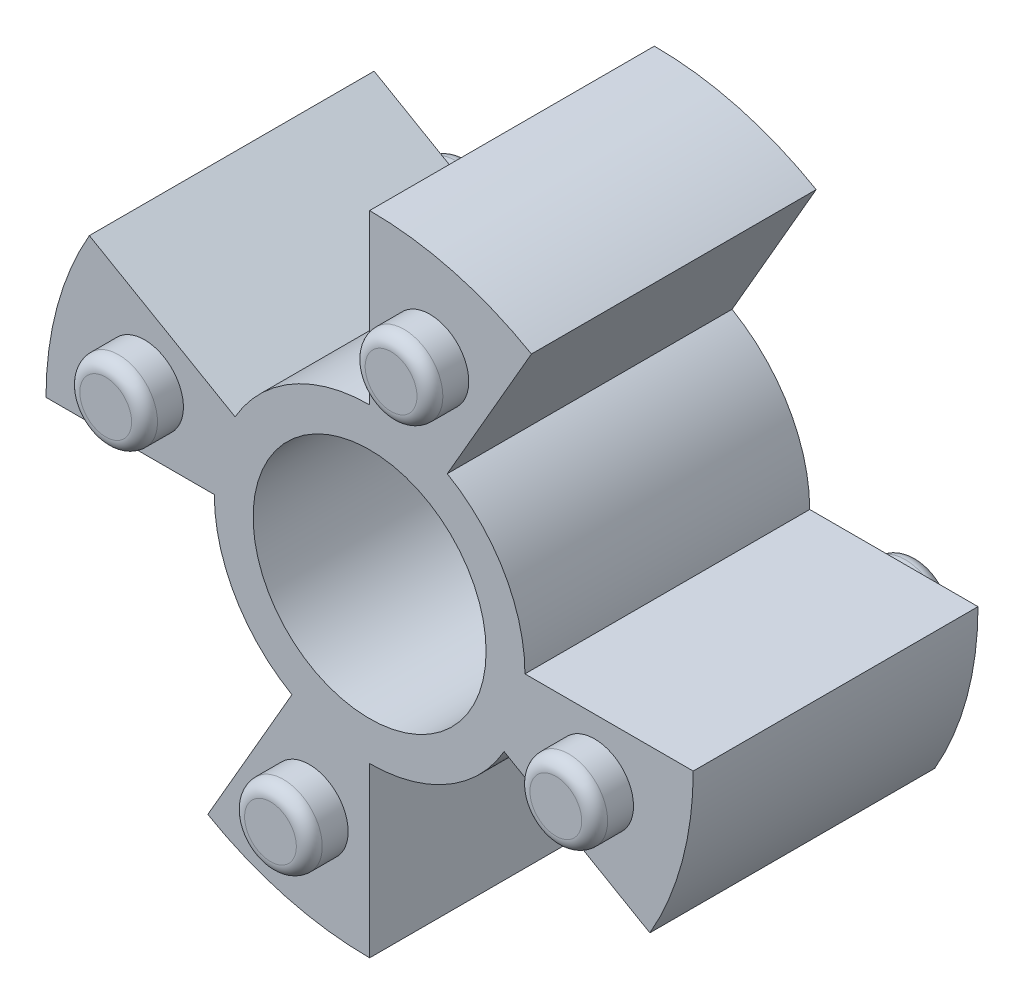
ISO-10303-21;
HEADER;
FILE_DESCRIPTION(('STEP AP214'),'2;1');
FILE_NAME('part.step','',(''),(''),'','','');
FILE_SCHEMA(('AUTOMOTIVE_DESIGN { 1 0 10303 214 1 1 1 1 }'));
ENDSEC;
DATA;
#1=APPLICATION_CONTEXT('core data for automotive mechanical design processes');
#2=APPLICATION_PROTOCOL_DEFINITION('international standard','automotive_design',2000,#1);
#3=PRODUCT_CONTEXT('',#1,'mechanical');
#4=PRODUCT('Part','Part','',(#3));
#5=PRODUCT_RELATED_PRODUCT_CATEGORY('part','',(#4));
#6=PRODUCT_DEFINITION_FORMATION('','',#4);
#7=PRODUCT_DEFINITION_CONTEXT('part definition',#1,'design');
#8=PRODUCT_DEFINITION('design','',#6,#7);
#9=PRODUCT_DEFINITION_SHAPE('','',#8);
#10=(LENGTH_UNIT() NAMED_UNIT(*) SI_UNIT(.MILLI.,.METRE.));
#11=(NAMED_UNIT(*) PLANE_ANGLE_UNIT() SI_UNIT($,.RADIAN.));
#12=(NAMED_UNIT(*) SI_UNIT($,.STERADIAN.) SOLID_ANGLE_UNIT());
#13=UNCERTAINTY_MEASURE_WITH_UNIT(LENGTH_MEASURE(1.E-05),#10,'distance_accuracy_value','');
#14=(GEOMETRIC_REPRESENTATION_CONTEXT(3) GLOBAL_UNCERTAINTY_ASSIGNED_CONTEXT((#13)) GLOBAL_UNIT_ASSIGNED_CONTEXT((#10,
#11,#12)) REPRESENTATION_CONTEXT('',''));
#15=CARTESIAN_POINT('',(0.,0.,0.));
#16=DIRECTION('',(0.,0.,1.));
#17=DIRECTION('',(1.,0.,0.));
#18=AXIS2_PLACEMENT_3D('',#15,#16,#17);
#19=CARTESIAN_POINT('',(0.,0.,5.5));
#20=DIRECTION('',(0.,0.,1.));
#21=DIRECTION('',(1.,0.,0.));
#22=AXIS2_PLACEMENT_3D('',#19,#20,#21);
#23=PLANE('',#22);
#24=CARTESIAN_POINT('',(-8.69333243660161,2.32937140592269,5.5));
#25=DIRECTION('',(0.,0.,1.));
#26=DIRECTION('',(-1.,0.,0.));
#27=AXIS2_PLACEMENT_3D('',#24,#25,#26);
#28=CIRCLE('',#27,1.5);
#29=CARTESIAN_POINT('',(-10.1933324366016,2.32937140592269,5.5));
#30=VERTEX_POINT('',#29);
#31=EDGE_CURVE('E294',#30,#30,#28,.T.);
#32=ORIENTED_EDGE('',*,*,#31,.F.);
#33=EDGE_LOOP('',(#32));
#34=FACE_BOUND('',#33,.T.);
#35=CARTESIAN_POINT('',(8.69333243660161,-2.32937140592269,5.5));
#36=DIRECTION('',(0.,0.,1.));
#37=DIRECTION('',(1.,0.,0.));
#38=AXIS2_PLACEMENT_3D('',#35,#36,#37);
#39=CIRCLE('',#38,1.5);
#40=CARTESIAN_POINT('',(10.1933324366016,-2.32937140592269,5.5));
#41=VERTEX_POINT('',#40);
#42=EDGE_CURVE('E305',#41,#41,#39,.T.);
#43=ORIENTED_EDGE('',*,*,#42,.F.);
#44=EDGE_LOOP('',(#43));
#45=FACE_BOUND('',#44,.T.);
#46=DIRECTION('',(-1.,0.,0.));
#47=VECTOR('',#46,1.);
#48=CARTESIAN_POINT('',(-12.5,1.30930550206618E-13,5.5));
#49=LINE('',#48,#47);
#50=CARTESIAN_POINT('',(-6.,0.,5.5));
#51=VERTEX_POINT('',#50);
#52=CARTESIAN_POINT('',(-12.5,1.30930550206618E-13,5.5));
#53=VERTEX_POINT('',#52);
#54=EDGE_CURVE('E157',#51,#53,#49,.T.);
#55=ORIENTED_EDGE('',*,*,#54,.F.);
#56=CARTESIAN_POINT('',(0.,0.,5.5));
#57=DIRECTION('',(0.,0.,-1.));
#58=DIRECTION('',(0.,-1.,0.));
#59=AXIS2_PLACEMENT_3D('',#56,#57,#58);
#60=CIRCLE('',#59,6.);
#61=CARTESIAN_POINT('',(-3.00000000000004,-5.19615242270661,5.5));
#62=VERTEX_POINT('',#61);
#63=EDGE_CURVE('E313',#62,#51,#60,.T.);
#64=ORIENTED_EDGE('',*,*,#63,.F.);
#65=DIRECTION('',(0.500000000000007,0.866025403784435,0.));
#66=VECTOR('',#65,1.);
#67=CARTESIAN_POINT('',(-6.25000000000008,-10.8253175473054,5.5));
#68=LINE('',#67,#66);
#69=CARTESIAN_POINT('',(-6.25000000000008,-10.8253175473054,5.5));
#70=VERTEX_POINT('',#69);
#71=EDGE_CURVE('E307',#70,#62,#68,.T.);
#72=ORIENTED_EDGE('',*,*,#71,.F.);
#73=CARTESIAN_POINT('',(0.,0.,5.5));
#74=DIRECTION('',(0.,0.,1.));
#75=DIRECTION('',(1.,0.,0.));
#76=AXIS2_PLACEMENT_3D('',#73,#74,#75);
#77=CIRCLE('',#76,12.5);
#78=CARTESIAN_POINT('',(0.,-12.5,5.5));
#79=VERTEX_POINT('',#78);
#80=EDGE_CURVE('E165',#70,#79,#77,.T.);
#81=ORIENTED_EDGE('',*,*,#80,.T.);
#82=DIRECTION('',(0.,-1.,0.));
#83=VECTOR('',#82,1.);
#84=CARTESIAN_POINT('',(0.,-12.5,5.5));
#85=LINE('',#84,#83);
#86=CARTESIAN_POINT('',(0.,-6.,5.5));
#87=VERTEX_POINT('',#86);
#88=EDGE_CURVE('E327',#87,#79,#85,.T.);
#89=ORIENTED_EDGE('',*,*,#88,.F.);
#90=CARTESIAN_POINT('',(0.,0.,5.5));
#91=DIRECTION('',(0.,0.,-1.));
#92=DIRECTION('',(1.,0.,0.));
#93=AXIS2_PLACEMENT_3D('',#90,#91,#92);
#94=CIRCLE('',#93,6.);
#95=CARTESIAN_POINT('',(5.19615242270664,-2.99999999999998,5.5));
#96=VERTEX_POINT('',#95);
#97=EDGE_CURVE('E333',#96,#87,#94,.T.);
#98=ORIENTED_EDGE('',*,*,#97,.F.);
#99=DIRECTION('',(-0.86602540378444,0.499999999999998,0.));
#100=VECTOR('',#99,1.);
#101=CARTESIAN_POINT('',(10.8253175473055,-6.24999999999997,5.5));
#102=LINE('',#101,#100);
#103=CARTESIAN_POINT('',(10.8253175473055,-6.24999999999997,5.5));
#104=VERTEX_POINT('',#103);
#105=EDGE_CURVE('E320',#104,#96,#102,.T.);
#106=ORIENTED_EDGE('',*,*,#105,.F.);
#107=CARTESIAN_POINT('',(12.5,0.,5.5));
#108=VERTEX_POINT('',#107);
#109=EDGE_CURVE('E406',#104,#108,#77,.T.);
#110=ORIENTED_EDGE('',*,*,#109,.T.);
#111=DIRECTION('',(1.,0.,0.));
#112=VECTOR('',#111,1.);
#113=CARTESIAN_POINT('',(12.5,0.,5.5));
#114=LINE('',#113,#112);
#115=CARTESIAN_POINT('',(6.,0.,5.5));
#116=VERTEX_POINT('',#115);
#117=EDGE_CURVE('E350',#116,#108,#114,.T.);
#118=ORIENTED_EDGE('',*,*,#117,.F.);
#119=CARTESIAN_POINT('',(0.,0.,5.5));
#120=DIRECTION('',(0.,0.,-1.));
#121=DIRECTION('',(0.,1.,0.));
#122=AXIS2_PLACEMENT_3D('',#119,#120,#121);
#123=CIRCLE('',#122,6.);
#124=CARTESIAN_POINT('',(3.,5.19615242270663,5.5));
#125=VERTEX_POINT('',#124);
#126=EDGE_CURVE('E359',#125,#116,#123,.T.);
#127=ORIENTED_EDGE('',*,*,#126,.F.);
#128=DIRECTION('',(-0.500000000000001,-0.866025403784438,0.));
#129=VECTOR('',#128,1.);
#130=CARTESIAN_POINT('',(6.25000000000001,10.8253175473055,5.5));
#131=LINE('',#130,#129);
#132=CARTESIAN_POINT('',(6.25000000000001,10.8253175473055,5.5));
#133=VERTEX_POINT('',#132);
#134=EDGE_CURVE('E340',#133,#125,#131,.T.);
#135=ORIENTED_EDGE('',*,*,#134,.F.);
#136=CARTESIAN_POINT('',(0.,12.5,5.5));
#137=VERTEX_POINT('',#136);
#138=EDGE_CURVE('E400',#133,#137,#77,.T.);
#139=ORIENTED_EDGE('',*,*,#138,.T.);
#140=DIRECTION('',(0.,1.,0.));
#141=VECTOR('',#140,1.);
#142=CARTESIAN_POINT('',(0.,12.5,5.5));
#143=LINE('',#142,#141);
#144=CARTESIAN_POINT('',(0.,6.,5.5));
#145=VERTEX_POINT('',#144);
#146=EDGE_CURVE('E377',#145,#137,#143,.T.);
#147=ORIENTED_EDGE('',*,*,#146,.F.);
#148=CARTESIAN_POINT('',(0.,0.,5.5));
#149=DIRECTION('',(0.,0.,-1.));
#150=DIRECTION('',(-1.,0.,0.));
#151=AXIS2_PLACEMENT_3D('',#148,#149,#150);
#152=CIRCLE('',#151,6.);
#153=CARTESIAN_POINT('',(-5.19615242270664,2.99999999999998,5.5));
#154=VERTEX_POINT('',#153);
#155=EDGE_CURVE('E386',#154,#145,#152,.T.);
#156=ORIENTED_EDGE('',*,*,#155,.F.);
#157=DIRECTION('',(0.86602540378444,-0.499999999999998,0.));
#158=VECTOR('',#157,1.);
#159=CARTESIAN_POINT('',(-10.8253175473055,6.24999999999997,5.5));
#160=LINE('',#159,#158);
#161=CARTESIAN_POINT('',(-10.8253175473055,6.24999999999997,5.5));
#162=VERTEX_POINT('',#161);
#163=EDGE_CURVE('E367',#162,#154,#160,.T.);
#164=ORIENTED_EDGE('',*,*,#163,.F.);
#165=EDGE_CURVE('E186',#162,#53,#77,.T.);
#166=ORIENTED_EDGE('',*,*,#165,.T.);
#167=EDGE_LOOP('',(#55,#64,#72,#81,#89,#98,#106,#110,#118,#127,#135,#139,#147,#156,#164,#166));
#168=FACE_BOUND('',#167,.T.);
#169=CARTESIAN_POINT('',(0.,0.,5.5));
#170=DIRECTION('',(0.,0.,1.));
#171=DIRECTION('',(1.,0.,0.));
#172=AXIS2_PLACEMENT_3D('',#169,#170,#171);
#173=CIRCLE('',#172,4.5);
#174=CARTESIAN_POINT('',(4.5,0.,5.5));
#175=VERTEX_POINT('',#174);
#176=EDGE_CURVE('E176',#175,#175,#173,.T.);
#177=ORIENTED_EDGE('',*,*,#176,.F.);
#178=EDGE_LOOP('',(#177));
#179=FACE_BOUND('',#178,.T.);
#180=CARTESIAN_POINT('',(-2.32937140592272,-8.6933324366016,5.5));
#181=DIRECTION('',(0.,0.,1.));
#182=DIRECTION('',(0.,-1.,0.));
#183=AXIS2_PLACEMENT_3D('',#180,#181,#182);
#184=CIRCLE('',#183,1.5);
#185=CARTESIAN_POINT('',(-2.32937140592273,-10.1933324366016,5.5));
#186=VERTEX_POINT('',#185);
#187=EDGE_CURVE('E299',#186,#186,#184,.T.);
#188=ORIENTED_EDGE('',*,*,#187,.F.);
#189=EDGE_LOOP('',(#188));
#190=FACE_BOUND('',#189,.T.);
#191=CARTESIAN_POINT('',(2.32937140592278,8.69333243660159,5.5));
#192=DIRECTION('',(0.,0.,1.));
#193=DIRECTION('',(0.,1.,0.));
#194=AXIS2_PLACEMENT_3D('',#191,#192,#193);
#195=CIRCLE('',#194,1.5);
#196=CARTESIAN_POINT('',(2.3293714059228,10.1933324366016,5.5));
#197=VERTEX_POINT('',#196);
#198=EDGE_CURVE('E291',#197,#197,#195,.T.);
#199=ORIENTED_EDGE('',*,*,#198,.F.);
#200=EDGE_LOOP('',(#199));
#201=FACE_BOUND('',#200,.T.);
#202=ADVANCED_FACE('F36',(#34,#45,#168,#179,#190,#201),#23,.T.);
#203=CARTESIAN_POINT('',(0.,0.,5.5));
#204=DIRECTION('',(0.,0.,-1.));
#205=DIRECTION('',(-1.,0.,0.));
#206=AXIS2_PLACEMENT_3D('',#203,#204,#205);
#207=CYLINDRICAL_SURFACE('',#206,12.5);
#208=CARTESIAN_POINT('',(0.,0.,-5.5));
#209=DIRECTION('',(0.,0.,1.));
#210=DIRECTION('',(1.,0.,0.));
#211=AXIS2_PLACEMENT_3D('',#208,#209,#210);
#212=CIRCLE('',#211,12.5);
#213=CARTESIAN_POINT('',(-10.8253175473055,6.24999999999997,-5.5));
#214=VERTEX_POINT('',#213);
#215=CARTESIAN_POINT('',(-12.5,1.30930550206618E-13,-5.5));
#216=VERTEX_POINT('',#215);
#217=EDGE_CURVE('E172',#214,#216,#212,.T.);
#218=ORIENTED_EDGE('',*,*,#217,.T.);
#219=DIRECTION('',(0.,0.,1.));
#220=VECTOR('',#219,1.);
#221=CARTESIAN_POINT('',(-12.5,1.30930550206618E-13,-5.5));
#222=LINE('',#221,#220);
#223=EDGE_CURVE('E317',#216,#53,#222,.T.);
#224=ORIENTED_EDGE('',*,*,#223,.T.);
#225=ORIENTED_EDGE('',*,*,#165,.F.);
#226=DIRECTION('',(0.,0.,1.));
#227=VECTOR('',#226,1.);
#228=CARTESIAN_POINT('',(-10.8253175473055,6.24999999999997,-5.5));
#229=LINE('',#228,#227);
#230=EDGE_CURVE('E383',#214,#162,#229,.T.);
#231=ORIENTED_EDGE('',*,*,#230,.F.);
#232=EDGE_LOOP('',(#218,#224,#225,#231));
#233=FACE_BOUND('',#232,.T.);
#234=ADVANCED_FACE('F226',(#233),#207,.T.);
#235=ORIENTED_EDGE('',*,*,#80,.F.);
#236=DIRECTION('',(0.,0.,1.));
#237=VECTOR('',#236,1.);
#238=CARTESIAN_POINT('',(-6.25000000000008,-10.8253175473054,-5.5));
#239=LINE('',#238,#237);
#240=CARTESIAN_POINT('',(-6.25000000000008,-10.8253175473054,-5.5));
#241=VERTEX_POINT('',#240);
#242=EDGE_CURVE('E152',#241,#70,#239,.T.);
#243=ORIENTED_EDGE('',*,*,#242,.F.);
#244=CARTESIAN_POINT('',(0.,-12.5,-5.5));
#245=VERTEX_POINT('',#244);
#246=EDGE_CURVE('E163',#241,#245,#212,.T.);
#247=ORIENTED_EDGE('',*,*,#246,.T.);
#248=DIRECTION('',(0.,0.,1.));
#249=VECTOR('',#248,1.);
#250=CARTESIAN_POINT('',(0.,-12.5,-5.5));
#251=LINE('',#250,#249);
#252=EDGE_CURVE('E338',#245,#79,#251,.T.);
#253=ORIENTED_EDGE('',*,*,#252,.T.);
#254=EDGE_LOOP('',(#235,#243,#247,#253));
#255=FACE_BOUND('',#254,.T.);
#256=ADVANCED_FACE('F161',(#255),#207,.T.);
#257=ORIENTED_EDGE('',*,*,#109,.F.);
#258=DIRECTION('',(0.,0.,1.));
#259=VECTOR('',#258,1.);
#260=CARTESIAN_POINT('',(10.8253175473055,-6.24999999999997,-5.5));
#261=LINE('',#260,#259);
#262=CARTESIAN_POINT('',(10.8253175473055,-6.24999999999997,-5.5));
#263=VERTEX_POINT('',#262);
#264=EDGE_CURVE('E330',#263,#104,#261,.T.);
#265=ORIENTED_EDGE('',*,*,#264,.F.);
#266=CARTESIAN_POINT('',(12.5,0.,-5.5));
#267=VERTEX_POINT('',#266);
#268=EDGE_CURVE('E173',#263,#267,#212,.T.);
#269=ORIENTED_EDGE('',*,*,#268,.T.);
#270=DIRECTION('',(0.,0.,1.));
#271=VECTOR('',#270,1.);
#272=CARTESIAN_POINT('',(12.5,0.,-5.5));
#273=LINE('',#272,#271);
#274=EDGE_CURVE('E364',#267,#108,#273,.T.);
#275=ORIENTED_EDGE('',*,*,#274,.T.);
#276=EDGE_LOOP('',(#257,#265,#269,#275));
#277=FACE_BOUND('',#276,.T.);
#278=ADVANCED_FACE('F248',(#277),#207,.T.);
#279=CARTESIAN_POINT('',(0.,0.,5.5));
#280=DIRECTION('',(0.,0.,-1.));
#281=DIRECTION('',(-1.,0.,0.));
#282=AXIS2_PLACEMENT_3D('',#279,#280,#281);
#283=CYLINDRICAL_SURFACE('',#282,4.5);
#284=ORIENTED_EDGE('',*,*,#176,.T.);
#285=EDGE_LOOP('',(#284));
#286=FACE_BOUND('',#285,.T.);
#287=CARTESIAN_POINT('',(0.,0.,-5.5));
#288=DIRECTION('',(0.,0.,1.));
#289=DIRECTION('',(1.,0.,0.));
#290=AXIS2_PLACEMENT_3D('',#287,#288,#289);
#291=CIRCLE('',#290,4.5);
#292=CARTESIAN_POINT('',(4.5,0.,-5.5));
#293=VERTEX_POINT('',#292);
#294=EDGE_CURVE('E180',#293,#293,#291,.T.);
#295=ORIENTED_EDGE('',*,*,#294,.F.);
#296=EDGE_LOOP('',(#295));
#297=FACE_BOUND('',#296,.T.);
#298=ADVANCED_FACE('F246',(#286,#297),#283,.F.);
#299=ORIENTED_EDGE('',*,*,#138,.F.);
#300=DIRECTION('',(0.,0.,1.));
#301=VECTOR('',#300,1.);
#302=CARTESIAN_POINT('',(6.25000000000001,10.8253175473055,-5.5));
#303=LINE('',#302,#301);
#304=CARTESIAN_POINT('',(6.25000000000001,10.8253175473055,-5.5));
#305=VERTEX_POINT('',#304);
#306=EDGE_CURVE('E356',#305,#133,#303,.T.);
#307=ORIENTED_EDGE('',*,*,#306,.F.);
#308=CARTESIAN_POINT('',(0.,12.5,-5.5));
#309=VERTEX_POINT('',#308);
#310=EDGE_CURVE('E177',#305,#309,#212,.T.);
#311=ORIENTED_EDGE('',*,*,#310,.T.);
#312=DIRECTION('',(0.,0.,1.));
#313=VECTOR('',#312,1.);
#314=CARTESIAN_POINT('',(0.,12.5,-5.5));
#315=LINE('',#314,#313);
#316=EDGE_CURVE('E391',#309,#137,#315,.T.);
#317=ORIENTED_EDGE('',*,*,#316,.T.);
#318=EDGE_LOOP('',(#299,#307,#311,#317));
#319=FACE_BOUND('',#318,.T.);
#320=ADVANCED_FACE('F234',(#319),#207,.T.);
#321=CARTESIAN_POINT('',(0.,0.,-5.5));
#322=DIRECTION('',(0.,0.,1.));
#323=DIRECTION('',(1.,0.,0.));
#324=AXIS2_PLACEMENT_3D('',#321,#322,#323);
#325=PLANE('',#324);
#326=CARTESIAN_POINT('',(-8.69333243660161,2.32937140592269,-5.5));
#327=DIRECTION('',(0.,0.,1.));
#328=DIRECTION('',(-1.,0.,0.));
#329=AXIS2_PLACEMENT_3D('',#326,#327,#328);
#330=CIRCLE('',#329,1.5);
#331=CARTESIAN_POINT('',(-10.1933324366016,2.32937140592269,-5.5));
#332=VERTEX_POINT('',#331);
#333=EDGE_CURVE('E290',#332,#332,#330,.T.);
#334=ORIENTED_EDGE('',*,*,#333,.T.);
#335=EDGE_LOOP('',(#334));
#336=FACE_BOUND('',#335,.T.);
#337=CARTESIAN_POINT('',(8.69333243660161,-2.32937140592269,-5.5));
#338=DIRECTION('',(0.,0.,1.));
#339=DIRECTION('',(1.,0.,0.));
#340=AXIS2_PLACEMENT_3D('',#337,#338,#339);
#341=CIRCLE('',#340,1.5);
#342=CARTESIAN_POINT('',(10.1933324366016,-2.32937140592269,-5.5));
#343=VERTEX_POINT('',#342);
#344=EDGE_CURVE('E302',#343,#343,#341,.T.);
#345=ORIENTED_EDGE('',*,*,#344,.T.);
#346=EDGE_LOOP('',(#345));
#347=FACE_BOUND('',#346,.T.);
#348=ORIENTED_EDGE('',*,*,#294,.T.);
#349=EDGE_LOOP('',(#348));
#350=FACE_BOUND('',#349,.T.);
#351=CARTESIAN_POINT('',(0.,0.,-5.5));
#352=DIRECTION('',(0.,0.,-1.));
#353=DIRECTION('',(0.,-1.,0.));
#354=AXIS2_PLACEMENT_3D('',#351,#352,#353);
#355=CIRCLE('',#354,6.);
#356=CARTESIAN_POINT('',(-3.00000000000004,-5.19615242270661,-5.5));
#357=VERTEX_POINT('',#356);
#358=CARTESIAN_POINT('',(-6.,0.,-5.5));
#359=VERTEX_POINT('',#358);
#360=EDGE_CURVE('E51',#357,#359,#355,.T.);
#361=ORIENTED_EDGE('',*,*,#360,.T.);
#362=DIRECTION('',(-1.,0.,0.));
#363=VECTOR('',#362,1.);
#364=CARTESIAN_POINT('',(-12.5,1.30930550206618E-13,-5.5));
#365=LINE('',#364,#363);
#366=EDGE_CURVE('E166',#359,#216,#365,.T.);
#367=ORIENTED_EDGE('',*,*,#366,.T.);
#368=ORIENTED_EDGE('',*,*,#217,.F.);
#369=DIRECTION('',(0.86602540378444,-0.499999999999998,0.));
#370=VECTOR('',#369,1.);
#371=CARTESIAN_POINT('',(-10.8253175473055,6.24999999999997,-5.5));
#372=LINE('',#371,#370);
#373=CARTESIAN_POINT('',(-5.19615242270664,2.99999999999999,-5.5));
#374=VERTEX_POINT('',#373);
#375=EDGE_CURVE('E373',#214,#374,#372,.T.);
#376=ORIENTED_EDGE('',*,*,#375,.T.);
#377=CARTESIAN_POINT('',(0.,0.,-5.5));
#378=DIRECTION('',(0.,0.,-1.));
#379=DIRECTION('',(-1.,0.,0.));
#380=AXIS2_PLACEMENT_3D('',#377,#378,#379);
#381=CIRCLE('',#380,6.);
#382=CARTESIAN_POINT('',(0.,6.,-5.5));
#383=VERTEX_POINT('',#382);
#384=EDGE_CURVE('E376',#374,#383,#381,.T.);
#385=ORIENTED_EDGE('',*,*,#384,.T.);
#386=DIRECTION('',(0.,1.,0.));
#387=VECTOR('',#386,1.);
#388=CARTESIAN_POINT('',(0.,12.5,-5.5));
#389=LINE('',#388,#387);
#390=EDGE_CURVE('E380',#383,#309,#389,.T.);
#391=ORIENTED_EDGE('',*,*,#390,.T.);
#392=ORIENTED_EDGE('',*,*,#310,.F.);
#393=DIRECTION('',(-0.500000000000001,-0.866025403784438,0.));
#394=VECTOR('',#393,1.);
#395=CARTESIAN_POINT('',(6.25000000000001,10.8253175473055,-5.5));
#396=LINE('',#395,#394);
#397=CARTESIAN_POINT('',(3.,5.19615242270663,-5.5));
#398=VERTEX_POINT('',#397);
#399=EDGE_CURVE('E346',#305,#398,#396,.T.);
#400=ORIENTED_EDGE('',*,*,#399,.T.);
#401=CARTESIAN_POINT('',(0.,0.,-5.5));
#402=DIRECTION('',(0.,0.,-1.));
#403=DIRECTION('',(0.,1.,0.));
#404=AXIS2_PLACEMENT_3D('',#401,#402,#403);
#405=CIRCLE('',#404,6.);
#406=CARTESIAN_POINT('',(6.,0.,-5.5));
#407=VERTEX_POINT('',#406);
#408=EDGE_CURVE('E349',#398,#407,#405,.T.);
#409=ORIENTED_EDGE('',*,*,#408,.T.);
#410=DIRECTION('',(1.,0.,0.));
#411=VECTOR('',#410,1.);
#412=CARTESIAN_POINT('',(12.5,0.,-5.5));
#413=LINE('',#412,#411);
#414=EDGE_CURVE('E353',#407,#267,#413,.T.);
#415=ORIENTED_EDGE('',*,*,#414,.T.);
#416=ORIENTED_EDGE('',*,*,#268,.F.);
#417=DIRECTION('',(-0.86602540378444,0.499999999999998,0.));
#418=VECTOR('',#417,1.);
#419=CARTESIAN_POINT('',(10.8253175473055,-6.24999999999997,-5.5));
#420=LINE('',#419,#418);
#421=CARTESIAN_POINT('',(5.19615242270664,-2.99999999999999,-5.5));
#422=VERTEX_POINT('',#421);
#423=EDGE_CURVE('E324',#263,#422,#420,.T.);
#424=ORIENTED_EDGE('',*,*,#423,.T.);
#425=CARTESIAN_POINT('',(0.,0.,-5.5));
#426=DIRECTION('',(0.,0.,-1.));
#427=DIRECTION('',(1.,0.,0.));
#428=AXIS2_PLACEMENT_3D('',#425,#426,#427);
#429=CIRCLE('',#428,6.);
#430=CARTESIAN_POINT('',(0.,-6.,-5.5));
#431=VERTEX_POINT('',#430);
#432=EDGE_CURVE('E59',#422,#431,#429,.T.);
#433=ORIENTED_EDGE('',*,*,#432,.T.);
#434=DIRECTION('',(0.,-1.,0.));
#435=VECTOR('',#434,1.);
#436=CARTESIAN_POINT('',(0.,-12.5,-5.5));
#437=LINE('',#436,#435);
#438=EDGE_CURVE('E171',#431,#245,#437,.T.);
#439=ORIENTED_EDGE('',*,*,#438,.T.);
#440=ORIENTED_EDGE('',*,*,#246,.F.);
#441=DIRECTION('',(0.500000000000007,0.866025403784435,0.));
#442=VECTOR('',#441,1.);
#443=CARTESIAN_POINT('',(-6.25000000000008,-10.8253175473054,-5.5));
#444=LINE('',#443,#442);
#445=EDGE_CURVE('E148',#241,#357,#444,.T.);
#446=ORIENTED_EDGE('',*,*,#445,.T.);
#447=EDGE_LOOP('',(#361,#367,#368,#376,#385,#391,#392,#400,#409,#415,#416,#424,#433,#439,#440,#446));
#448=FACE_BOUND('',#447,.T.);
#449=ADVANCED_FACE('F169',(#336,#347,#350,#448),#325,.F.);
#450=CARTESIAN_POINT('',(0.,12.5,-5.5));
#451=DIRECTION('',(1.,0.,0.));
#452=DIRECTION('',(0.,1.,0.));
#453=AXIS2_PLACEMENT_3D('',#450,#451,#452);
#454=PLANE('',#453);
#455=ORIENTED_EDGE('',*,*,#146,.T.);
#456=ORIENTED_EDGE('',*,*,#316,.F.);
#457=ORIENTED_EDGE('',*,*,#390,.F.);
#458=DIRECTION('',(0.,0.,1.));
#459=VECTOR('',#458,1.);
#460=CARTESIAN_POINT('',(0.,6.,-5.5));
#461=LINE('',#460,#459);
#462=EDGE_CURVE('E394',#383,#145,#461,.T.);
#463=ORIENTED_EDGE('',*,*,#462,.T.);
#464=EDGE_LOOP('',(#455,#456,#457,#463));
#465=FACE_BOUND('',#464,.T.);
#466=ADVANCED_FACE('F242',(#465),#454,.F.);
#467=CARTESIAN_POINT('',(0.,0.,-5.5));
#468=DIRECTION('',(0.,0.,1.));
#469=DIRECTION('',(1.,0.,0.));
#470=AXIS2_PLACEMENT_3D('',#467,#468,#469);
#471=CYLINDRICAL_SURFACE('',#470,6.);
#472=ORIENTED_EDGE('',*,*,#155,.T.);
#473=ORIENTED_EDGE('',*,*,#462,.F.);
#474=ORIENTED_EDGE('',*,*,#384,.F.);
#475=DIRECTION('',(0.,0.,1.));
#476=VECTOR('',#475,1.);
#477=CARTESIAN_POINT('',(-5.19615242270664,2.99999999999998,-5.5));
#478=LINE('',#477,#476);
#479=EDGE_CURVE('E396',#374,#154,#478,.T.);
#480=ORIENTED_EDGE('',*,*,#479,.T.);
#481=EDGE_LOOP('',(#472,#473,#474,#480));
#482=FACE_BOUND('',#481,.T.);
#483=ADVANCED_FACE('F436',(#482),#471,.T.);
#484=CARTESIAN_POINT('',(-10.8253175473055,6.24999999999997,-5.5));
#485=DIRECTION('',(-0.499999999999998,-0.86602540378444,0.));
#486=DIRECTION('',(0.86602540378444,-0.499999999999998,0.));
#487=AXIS2_PLACEMENT_3D('',#484,#485,#486);
#488=PLANE('',#487);
#489=ORIENTED_EDGE('',*,*,#163,.T.);
#490=ORIENTED_EDGE('',*,*,#479,.F.);
#491=ORIENTED_EDGE('',*,*,#375,.F.);
#492=ORIENTED_EDGE('',*,*,#230,.T.);
#493=EDGE_LOOP('',(#489,#490,#491,#492));
#494=FACE_BOUND('',#493,.T.);
#495=ADVANCED_FACE('F239',(#494),#488,.F.);
#496=CARTESIAN_POINT('',(12.5,0.,-5.5));
#497=DIRECTION('',(0.,-1.,0.));
#498=DIRECTION('',(1.,0.,0.));
#499=AXIS2_PLACEMENT_3D('',#496,#497,#498);
#500=PLANE('',#499);
#501=ORIENTED_EDGE('',*,*,#117,.T.);
#502=ORIENTED_EDGE('',*,*,#274,.F.);
#503=ORIENTED_EDGE('',*,*,#414,.F.);
#504=DIRECTION('',(0.,0.,1.));
#505=VECTOR('',#504,1.);
#506=CARTESIAN_POINT('',(6.,0.,-5.5));
#507=LINE('',#506,#505);
#508=EDGE_CURVE('E368',#407,#116,#507,.T.);
#509=ORIENTED_EDGE('',*,*,#508,.T.);
#510=EDGE_LOOP('',(#501,#502,#503,#509));
#511=FACE_BOUND('',#510,.T.);
#512=ADVANCED_FACE('F420',(#511),#500,.F.);
#513=CARTESIAN_POINT('',(0.,0.,-5.5));
#514=DIRECTION('',(0.,0.,1.));
#515=DIRECTION('',(1.,0.,0.));
#516=AXIS2_PLACEMENT_3D('',#513,#514,#515);
#517=CYLINDRICAL_SURFACE('',#516,6.);
#518=ORIENTED_EDGE('',*,*,#126,.T.);
#519=ORIENTED_EDGE('',*,*,#508,.F.);
#520=ORIENTED_EDGE('',*,*,#408,.F.);
#521=DIRECTION('',(0.,0.,1.));
#522=VECTOR('',#521,1.);
#523=CARTESIAN_POINT('',(3.,5.19615242270663,-5.5));
#524=LINE('',#523,#522);
#525=EDGE_CURVE('E370',#398,#125,#524,.T.);
#526=ORIENTED_EDGE('',*,*,#525,.T.);
#527=EDGE_LOOP('',(#518,#519,#520,#526));
#528=FACE_BOUND('',#527,.T.);
#529=ADVANCED_FACE('F426',(#528),#517,.T.);
#530=CARTESIAN_POINT('',(6.25000000000001,10.8253175473055,-5.5));
#531=DIRECTION('',(-0.866025403784438,0.500000000000001,0.));
#532=DIRECTION('',(-0.500000000000001,-0.866025403784438,0.));
#533=AXIS2_PLACEMENT_3D('',#530,#531,#532);
#534=PLANE('',#533);
#535=ORIENTED_EDGE('',*,*,#134,.T.);
#536=ORIENTED_EDGE('',*,*,#525,.F.);
#537=ORIENTED_EDGE('',*,*,#399,.F.);
#538=ORIENTED_EDGE('',*,*,#306,.T.);
#539=EDGE_LOOP('',(#535,#536,#537,#538));
#540=FACE_BOUND('',#539,.T.);
#541=ADVANCED_FACE('F428',(#540),#534,.F.);
#542=CARTESIAN_POINT('',(0.,-12.5,-5.5));
#543=DIRECTION('',(-1.,0.,0.));
#544=DIRECTION('',(0.,-1.,0.));
#545=AXIS2_PLACEMENT_3D('',#542,#543,#544);
#546=PLANE('',#545);
#547=ORIENTED_EDGE('',*,*,#88,.T.);
#548=ORIENTED_EDGE('',*,*,#252,.F.);
#549=ORIENTED_EDGE('',*,*,#438,.F.);
#550=DIRECTION('',(0.,0.,1.));
#551=VECTOR('',#550,1.);
#552=CARTESIAN_POINT('',(0.,-6.,-5.5));
#553=LINE('',#552,#551);
#554=EDGE_CURVE('E341',#431,#87,#553,.T.);
#555=ORIENTED_EDGE('',*,*,#554,.T.);
#556=EDGE_LOOP('',(#547,#548,#549,#555));
#557=FACE_BOUND('',#556,.T.);
#558=ADVANCED_FACE('F457',(#557),#546,.F.);
#559=CARTESIAN_POINT('',(0.,0.,-5.5));
#560=DIRECTION('',(0.,0.,1.));
#561=DIRECTION('',(1.,0.,0.));
#562=AXIS2_PLACEMENT_3D('',#559,#560,#561);
#563=CYLINDRICAL_SURFACE('',#562,6.);
#564=ORIENTED_EDGE('',*,*,#97,.T.);
#565=ORIENTED_EDGE('',*,*,#554,.F.);
#566=ORIENTED_EDGE('',*,*,#432,.F.);
#567=DIRECTION('',(0.,0.,1.));
#568=VECTOR('',#567,1.);
#569=CARTESIAN_POINT('',(5.19615242270664,-2.99999999999998,-5.5));
#570=LINE('',#569,#568);
#571=EDGE_CURVE('E343',#422,#96,#570,.T.);
#572=ORIENTED_EDGE('',*,*,#571,.T.);
#573=EDGE_LOOP('',(#564,#565,#566,#572));
#574=FACE_BOUND('',#573,.T.);
#575=ADVANCED_FACE('F460',(#574),#563,.T.);
#576=CARTESIAN_POINT('',(10.8253175473055,-6.24999999999997,-5.5));
#577=DIRECTION('',(0.499999999999998,0.86602540378444,0.));
#578=DIRECTION('',(-0.86602540378444,0.499999999999998,0.));
#579=AXIS2_PLACEMENT_3D('',#576,#577,#578);
#580=PLANE('',#579);
#581=ORIENTED_EDGE('',*,*,#105,.T.);
#582=ORIENTED_EDGE('',*,*,#571,.F.);
#583=ORIENTED_EDGE('',*,*,#423,.F.);
#584=ORIENTED_EDGE('',*,*,#264,.T.);
#585=EDGE_LOOP('',(#581,#582,#583,#584));
#586=FACE_BOUND('',#585,.T.);
#587=ADVANCED_FACE('F453',(#586),#580,.F.);
#588=CARTESIAN_POINT('',(-12.5,1.30930550206618E-13,-5.5));
#589=DIRECTION('',(0.,1.,0.));
#590=DIRECTION('',(-1.,0.,0.));
#591=AXIS2_PLACEMENT_3D('',#588,#589,#590);
#592=PLANE('',#591);
#593=ORIENTED_EDGE('',*,*,#54,.T.);
#594=ORIENTED_EDGE('',*,*,#223,.F.);
#595=ORIENTED_EDGE('',*,*,#366,.F.);
#596=DIRECTION('',(0.,0.,1.));
#597=VECTOR('',#596,1.);
#598=CARTESIAN_POINT('',(-6.,0.,-5.5));
#599=LINE('',#598,#597);
#600=EDGE_CURVE('E321',#359,#51,#599,.T.);
#601=ORIENTED_EDGE('',*,*,#600,.T.);
#602=EDGE_LOOP('',(#593,#594,#595,#601));
#603=FACE_BOUND('',#602,.T.);
#604=ADVANCED_FACE('F442',(#603),#592,.F.);
#605=CARTESIAN_POINT('',(0.,0.,-5.5));
#606=DIRECTION('',(0.,0.,1.));
#607=DIRECTION('',(1.,0.,0.));
#608=AXIS2_PLACEMENT_3D('',#605,#606,#607);
#609=CYLINDRICAL_SURFACE('',#608,6.);
#610=ORIENTED_EDGE('',*,*,#63,.T.);
#611=ORIENTED_EDGE('',*,*,#600,.F.);
#612=ORIENTED_EDGE('',*,*,#360,.F.);
#613=DIRECTION('',(0.,0.,1.));
#614=VECTOR('',#613,1.);
#615=CARTESIAN_POINT('',(-3.00000000000004,-5.19615242270661,-5.5));
#616=LINE('',#615,#614);
#617=EDGE_CURVE('E154',#357,#62,#616,.T.);
#618=ORIENTED_EDGE('',*,*,#617,.T.);
#619=EDGE_LOOP('',(#610,#611,#612,#618));
#620=FACE_BOUND('',#619,.T.);
#621=ADVANCED_FACE('F444',(#620),#609,.T.);
#622=CARTESIAN_POINT('',(-6.25000000000008,-10.8253175473054,-5.5));
#623=DIRECTION('',(0.866025403784435,-0.500000000000007,0.));
#624=DIRECTION('',(0.500000000000007,0.866025403784435,0.));
#625=AXIS2_PLACEMENT_3D('',#622,#623,#624);
#626=PLANE('',#625);
#627=ORIENTED_EDGE('',*,*,#71,.T.);
#628=ORIENTED_EDGE('',*,*,#617,.F.);
#629=ORIENTED_EDGE('',*,*,#445,.F.);
#630=ORIENTED_EDGE('',*,*,#242,.T.);
#631=EDGE_LOOP('',(#627,#628,#629,#630));
#632=FACE_BOUND('',#631,.T.);
#633=ADVANCED_FACE('F151',(#632),#626,.F.);
#634=CARTESIAN_POINT('',(8.69333243660161,-2.32937140592269,7.));
#635=DIRECTION('',(0.,0.,-1.));
#636=DIRECTION('',(-1.,0.,0.));
#637=AXIS2_PLACEMENT_3D('',#634,#635,#636);
#638=CYLINDRICAL_SURFACE('',#637,1.5);
#639=CARTESIAN_POINT('',(8.69333243660161,-2.32937140592269,6.5));
#640=DIRECTION('',(0.,0.,1.));
#641=DIRECTION('',(1.,0.,0.));
#642=AXIS2_PLACEMENT_3D('',#639,#640,#641);
#643=CIRCLE('',#642,1.5);
#644=CARTESIAN_POINT('',(10.1933324366016,-2.32937140592269,6.5));
#645=VERTEX_POINT('',#644);
#646=EDGE_CURVE('E185',#645,#645,#643,.F.);
#647=ORIENTED_EDGE('',*,*,#646,.T.);
#648=EDGE_LOOP('',(#647));
#649=FACE_BOUND('',#648,.T.);
#650=ORIENTED_EDGE('',*,*,#42,.T.);
#651=EDGE_LOOP('',(#650));
#652=FACE_BOUND('',#651,.T.);
#653=ADVANCED_FACE('F451',(#649,#652),#638,.T.);
#654=CARTESIAN_POINT('',(8.69333243660161,-2.32937140592269,7.));
#655=DIRECTION('',(0.,0.,1.));
#656=DIRECTION('',(1.,0.,0.));
#657=AXIS2_PLACEMENT_3D('',#654,#655,#656);
#658=PLANE('',#657);
#659=CARTESIAN_POINT('',(8.69333243660161,-2.32937140592269,7.));
#660=DIRECTION('',(0.,0.,1.));
#661=DIRECTION('',(1.,0.,0.));
#662=AXIS2_PLACEMENT_3D('',#659,#660,#661);
#663=CIRCLE('',#662,0.999999999999999);
#664=CARTESIAN_POINT('',(9.69333243660161,-2.32937140592269,7.));
#665=VERTEX_POINT('',#664);
#666=EDGE_CURVE('E182',#665,#665,#663,.T.);
#667=ORIENTED_EDGE('',*,*,#666,.T.);
#668=EDGE_LOOP('',(#667));
#669=FACE_BOUND('',#668,.T.);
#670=ADVANCED_FACE('F256',(#669),#658,.T.);
#671=CARTESIAN_POINT('',(8.69333243660161,-2.32937140592269,6.5));
#672=DIRECTION('',(0.,0.,1.));
#673=DIRECTION('',(1.,0.,0.));
#674=AXIS2_PLACEMENT_3D('',#671,#672,#673);
#675=TOROIDAL_SURFACE('',#674,0.999999999999999,0.5);
#676=ORIENTED_EDGE('',*,*,#646,.F.);
#677=EDGE_LOOP('',(#676));
#678=FACE_BOUND('',#677,.T.);
#679=ORIENTED_EDGE('',*,*,#666,.F.);
#680=EDGE_LOOP('',(#679));
#681=FACE_BOUND('',#680,.T.);
#682=ADVANCED_FACE('F252',(#678,#681),#675,.T.);
#683=CARTESIAN_POINT('',(8.69333243660161,-2.32937140592269,-7.));
#684=DIRECTION('',(0.,0.,1.));
#685=DIRECTION('',(1.,0.,0.));
#686=AXIS2_PLACEMENT_3D('',#683,#684,#685);
#687=CYLINDRICAL_SURFACE('',#686,1.5);
#688=CARTESIAN_POINT('',(8.69333243660161,-2.32937140592269,-6.5));
#689=DIRECTION('',(0.,0.,-1.));
#690=DIRECTION('',(-1.,0.,0.));
#691=AXIS2_PLACEMENT_3D('',#688,#689,#690);
#692=CIRCLE('',#691,1.5);
#693=CARTESIAN_POINT('',(7.19333243660161,-2.32937140592269,-6.5));
#694=VERTEX_POINT('',#693);
#695=EDGE_CURVE('E189',#694,#694,#692,.F.);
#696=ORIENTED_EDGE('',*,*,#695,.T.);
#697=EDGE_LOOP('',(#696));
#698=FACE_BOUND('',#697,.T.);
#699=ORIENTED_EDGE('',*,*,#344,.F.);
#700=EDGE_LOOP('',(#699));
#701=FACE_BOUND('',#700,.T.);
#702=ADVANCED_FACE('F255',(#698,#701),#687,.T.);
#703=CARTESIAN_POINT('',(8.69333243660161,-2.32937140592269,-7.));
#704=DIRECTION('',(0.,0.,-1.));
#705=DIRECTION('',(1.,0.,0.));
#706=AXIS2_PLACEMENT_3D('',#703,#704,#705);
#707=PLANE('',#706);
#708=CARTESIAN_POINT('',(8.69333243660161,-2.32937140592269,-7.));
#709=DIRECTION('',(0.,0.,-1.));
#710=DIRECTION('',(-1.,0.,0.));
#711=AXIS2_PLACEMENT_3D('',#708,#709,#710);
#712=CIRCLE('',#711,0.999999999999999);
#713=CARTESIAN_POINT('',(7.69333243660161,-2.32937140592269,-7.));
#714=VERTEX_POINT('',#713);
#715=EDGE_CURVE('E192',#714,#714,#712,.T.);
#716=ORIENTED_EDGE('',*,*,#715,.T.);
#717=EDGE_LOOP('',(#716));
#718=FACE_BOUND('',#717,.T.);
#719=ADVANCED_FACE('F262',(#718),#707,.T.);
#720=CARTESIAN_POINT('',(8.69333243660161,-2.32937140592269,-6.5));
#721=DIRECTION('',(0.,0.,-1.));
#722=DIRECTION('',(-1.,0.,0.));
#723=AXIS2_PLACEMENT_3D('',#720,#721,#722);
#724=TOROIDAL_SURFACE('',#723,0.999999999999999,0.5);
#725=ORIENTED_EDGE('',*,*,#715,.F.);
#726=EDGE_LOOP('',(#725));
#727=FACE_BOUND('',#726,.T.);
#728=ORIENTED_EDGE('',*,*,#695,.F.);
#729=EDGE_LOOP('',(#728));
#730=FACE_BOUND('',#729,.T.);
#731=ADVANCED_FACE('F258',(#727,#730),#724,.T.);
#732=CARTESIAN_POINT('',(-2.32937140592272,-8.6933324366016,7.));
#733=DIRECTION('',(0.,0.,-1.));
#734=DIRECTION('',(-1.,0.,0.));
#735=AXIS2_PLACEMENT_3D('',#732,#733,#734);
#736=CYLINDRICAL_SURFACE('',#735,1.5);
#737=CARTESIAN_POINT('',(-2.32937140592272,-8.6933324366016,6.5));
#738=DIRECTION('',(0.,0.,1.));
#739=DIRECTION('',(1.,0.,0.));
#740=AXIS2_PLACEMENT_3D('',#737,#738,#739);
#741=CIRCLE('',#740,1.5);
#742=CARTESIAN_POINT('',(-0.829371405922721,-8.6933324366016,6.5));
#743=VERTEX_POINT('',#742);
#744=EDGE_CURVE('E198',#743,#743,#741,.F.);
#745=ORIENTED_EDGE('',*,*,#744,.T.);
#746=EDGE_LOOP('',(#745));
#747=FACE_BOUND('',#746,.T.);
#748=ORIENTED_EDGE('',*,*,#187,.T.);
#749=EDGE_LOOP('',(#748));
#750=FACE_BOUND('',#749,.T.);
#751=ADVANCED_FACE('F261',(#747,#750),#736,.T.);
#752=CARTESIAN_POINT('',(-2.32937140592272,-8.6933324366016,7.));
#753=DIRECTION('',(0.,0.,1.));
#754=DIRECTION('',(0.,-1.,0.));
#755=AXIS2_PLACEMENT_3D('',#752,#753,#754);
#756=PLANE('',#755);
#757=CARTESIAN_POINT('',(-2.32937140592272,-8.6933324366016,7.));
#758=DIRECTION('',(0.,0.,1.));
#759=DIRECTION('',(1.,0.,0.));
#760=AXIS2_PLACEMENT_3D('',#757,#758,#759);
#761=CIRCLE('',#760,0.999999999999999);
#762=CARTESIAN_POINT('',(-1.32937140592272,-8.6933324366016,7.));
#763=VERTEX_POINT('',#762);
#764=EDGE_CURVE('E195',#763,#763,#761,.T.);
#765=ORIENTED_EDGE('',*,*,#764,.T.);
#766=EDGE_LOOP('',(#765));
#767=FACE_BOUND('',#766,.T.);
#768=ADVANCED_FACE('F580',(#767),#756,.T.);
#769=CARTESIAN_POINT('',(-8.69333243660161,2.32937140592269,7.));
#770=DIRECTION('',(0.,0.,-1.));
#771=DIRECTION('',(-1.,0.,0.));
#772=AXIS2_PLACEMENT_3D('',#769,#770,#771);
#773=CYLINDRICAL_SURFACE('',#772,1.5);
#774=CARTESIAN_POINT('',(-8.69333243660161,2.32937140592269,6.5));
#775=DIRECTION('',(0.,0.,1.));
#776=DIRECTION('',(1.,0.,0.));
#777=AXIS2_PLACEMENT_3D('',#774,#775,#776);
#778=CIRCLE('',#777,1.5);
#779=CARTESIAN_POINT('',(-7.19333243660161,2.32937140592269,6.5));
#780=VERTEX_POINT('',#779);
#781=EDGE_CURVE('E11',#780,#780,#778,.F.);
#782=ORIENTED_EDGE('',*,*,#781,.T.);
#783=EDGE_LOOP('',(#782));
#784=FACE_BOUND('',#783,.T.);
#785=ORIENTED_EDGE('',*,*,#31,.T.);
#786=EDGE_LOOP('',(#785));
#787=FACE_BOUND('',#786,.T.);
#788=ADVANCED_FACE('F590',(#784,#787),#773,.T.);
#789=CARTESIAN_POINT('',(2.32937140592278,8.69333243660159,7.));
#790=DIRECTION('',(0.,0.,-1.));
#791=DIRECTION('',(-1.,0.,0.));
#792=AXIS2_PLACEMENT_3D('',#789,#790,#791);
#793=CYLINDRICAL_SURFACE('',#792,1.5);
#794=CARTESIAN_POINT('',(2.32937140592278,8.69333243660159,6.5));
#795=DIRECTION('',(0.,0.,1.));
#796=DIRECTION('',(1.,0.,0.));
#797=AXIS2_PLACEMENT_3D('',#794,#795,#796);
#798=CIRCLE('',#797,1.5);
#799=CARTESIAN_POINT('',(3.82937140592278,8.69333243660159,6.5));
#800=VERTEX_POINT('',#799);
#801=EDGE_CURVE('E204',#800,#800,#798,.F.);
#802=ORIENTED_EDGE('',*,*,#801,.T.);
#803=EDGE_LOOP('',(#802));
#804=FACE_BOUND('',#803,.T.);
#805=ORIENTED_EDGE('',*,*,#198,.T.);
#806=EDGE_LOOP('',(#805));
#807=FACE_BOUND('',#806,.T.);
#808=ADVANCED_FACE('F598',(#804,#807),#793,.T.);
#809=CARTESIAN_POINT('',(2.32937140592278,8.69333243660159,7.));
#810=DIRECTION('',(0.,0.,1.));
#811=DIRECTION('',(0.,1.,0.));
#812=AXIS2_PLACEMENT_3D('',#809,#810,#811);
#813=PLANE('',#812);
#814=CARTESIAN_POINT('',(2.32937140592278,8.69333243660159,7.));
#815=DIRECTION('',(0.,0.,1.));
#816=DIRECTION('',(1.,0.,0.));
#817=AXIS2_PLACEMENT_3D('',#814,#815,#816);
#818=CIRCLE('',#817,0.999999999999999);
#819=CARTESIAN_POINT('',(3.32937140592278,8.69333243660159,7.));
#820=VERTEX_POINT('',#819);
#821=EDGE_CURVE('E201',#820,#820,#818,.T.);
#822=ORIENTED_EDGE('',*,*,#821,.T.);
#823=EDGE_LOOP('',(#822));
#824=FACE_BOUND('',#823,.T.);
#825=ADVANCED_FACE('F268',(#824),#813,.T.);
#826=CARTESIAN_POINT('',(-2.32937140592272,-8.6933324366016,6.5));
#827=DIRECTION('',(0.,0.,1.));
#828=DIRECTION('',(1.,0.,0.));
#829=AXIS2_PLACEMENT_3D('',#826,#827,#828);
#830=TOROIDAL_SURFACE('',#829,0.999999999999999,0.5);
#831=ORIENTED_EDGE('',*,*,#744,.F.);
#832=EDGE_LOOP('',(#831));
#833=FACE_BOUND('',#832,.T.);
#834=ORIENTED_EDGE('',*,*,#764,.F.);
#835=EDGE_LOOP('',(#834));
#836=FACE_BOUND('',#835,.T.);
#837=ADVANCED_FACE('F264',(#833,#836),#830,.T.);
#838=CARTESIAN_POINT('',(2.32937140592278,8.69333243660159,6.5));
#839=DIRECTION('',(0.,0.,1.));
#840=DIRECTION('',(1.,0.,0.));
#841=AXIS2_PLACEMENT_3D('',#838,#839,#840);
#842=TOROIDAL_SURFACE('',#841,0.999999999999999,0.5);
#843=ORIENTED_EDGE('',*,*,#801,.F.);
#844=EDGE_LOOP('',(#843));
#845=FACE_BOUND('',#844,.T.);
#846=ORIENTED_EDGE('',*,*,#821,.F.);
#847=EDGE_LOOP('',(#846));
#848=FACE_BOUND('',#847,.T.);
#849=ADVANCED_FACE('F267',(#845,#848),#842,.T.);
#850=CARTESIAN_POINT('',(-8.69333243660161,2.32937140592269,-7.));
#851=DIRECTION('',(0.,0.,1.));
#852=DIRECTION('',(1.,0.,0.));
#853=AXIS2_PLACEMENT_3D('',#850,#851,#852);
#854=CYLINDRICAL_SURFACE('',#853,1.5);
#855=CARTESIAN_POINT('',(-8.69333243660161,2.32937140592269,-6.5));
#856=DIRECTION('',(0.,0.,-1.));
#857=DIRECTION('',(-1.,0.,0.));
#858=AXIS2_PLACEMENT_3D('',#855,#856,#857);
#859=CIRCLE('',#858,1.5);
#860=CARTESIAN_POINT('',(-10.1933324366016,2.32937140592269,-6.5));
#861=VERTEX_POINT('',#860);
#862=EDGE_CURVE('E207',#861,#861,#859,.F.);
#863=ORIENTED_EDGE('',*,*,#862,.T.);
#864=EDGE_LOOP('',(#863));
#865=FACE_BOUND('',#864,.T.);
#866=ORIENTED_EDGE('',*,*,#333,.F.);
#867=EDGE_LOOP('',(#866));
#868=FACE_BOUND('',#867,.T.);
#869=ADVANCED_FACE('F271',(#865,#868),#854,.T.);
#870=CARTESIAN_POINT('',(-8.69333243660161,2.32937140592269,-7.));
#871=DIRECTION('',(0.,0.,-1.));
#872=DIRECTION('',(-1.,0.,0.));
#873=AXIS2_PLACEMENT_3D('',#870,#871,#872);
#874=PLANE('',#873);
#875=CARTESIAN_POINT('',(-8.69333243660161,2.32937140592269,-7.));
#876=DIRECTION('',(0.,0.,-1.));
#877=DIRECTION('',(-1.,0.,0.));
#878=AXIS2_PLACEMENT_3D('',#875,#876,#877);
#879=CIRCLE('',#878,0.999999999999999);
#880=CARTESIAN_POINT('',(-9.69333243660161,2.32937140592269,-7.));
#881=VERTEX_POINT('',#880);
#882=EDGE_CURVE('E210',#881,#881,#879,.T.);
#883=ORIENTED_EDGE('',*,*,#882,.T.);
#884=EDGE_LOOP('',(#883));
#885=FACE_BOUND('',#884,.T.);
#886=ADVANCED_FACE('F274',(#885),#874,.T.);
#887=CARTESIAN_POINT('',(-8.69333243660161,2.32937140592269,-6.5));
#888=DIRECTION('',(0.,0.,-1.));
#889=DIRECTION('',(-1.,0.,0.));
#890=AXIS2_PLACEMENT_3D('',#887,#888,#889);
#891=TOROIDAL_SURFACE('',#890,0.999999999999999,0.5);
#892=ORIENTED_EDGE('',*,*,#882,.F.);
#893=EDGE_LOOP('',(#892));
#894=FACE_BOUND('',#893,.T.);
#895=ORIENTED_EDGE('',*,*,#862,.F.);
#896=EDGE_LOOP('',(#895));
#897=FACE_BOUND('',#896,.T.);
#898=ADVANCED_FACE('F222',(#894,#897),#891,.T.);
#899=CARTESIAN_POINT('',(-8.69333243660161,2.32937140592269,7.));
#900=DIRECTION('',(0.,0.,1.));
#901=DIRECTION('',(-1.,0.,0.));
#902=AXIS2_PLACEMENT_3D('',#899,#900,#901);
#903=PLANE('',#902);
#904=CARTESIAN_POINT('',(-8.69333243660161,2.32937140592269,7.));
#905=DIRECTION('',(0.,0.,1.));
#906=DIRECTION('',(1.,0.,0.));
#907=AXIS2_PLACEMENT_3D('',#904,#905,#906);
#908=CIRCLE('',#907,0.999999999999999);
#909=CARTESIAN_POINT('',(-7.69333243660161,2.32937140592269,7.));
#910=VERTEX_POINT('',#909);
#911=EDGE_CURVE('E44',#910,#910,#908,.T.);
#912=ORIENTED_EDGE('',*,*,#911,.T.);
#913=EDGE_LOOP('',(#912));
#914=FACE_BOUND('',#913,.T.);
#915=ADVANCED_FACE('F215',(#914),#903,.T.);
#916=CARTESIAN_POINT('',(-8.69333243660161,2.32937140592269,6.5));
#917=DIRECTION('',(0.,0.,1.));
#918=DIRECTION('',(1.,0.,0.));
#919=AXIS2_PLACEMENT_3D('',#916,#917,#918);
#920=TOROIDAL_SURFACE('',#919,0.999999999999999,0.5);
#921=ORIENTED_EDGE('',*,*,#781,.F.);
#922=EDGE_LOOP('',(#921));
#923=FACE_BOUND('',#922,.T.);
#924=ORIENTED_EDGE('',*,*,#911,.F.);
#925=EDGE_LOOP('',(#924));
#926=FACE_BOUND('',#925,.T.);
#927=ADVANCED_FACE('F38',(#923,#926),#920,.T.);
#928=CLOSED_SHELL('',(#202,#234,#256,#278,#298,#320,#449,#466,#483,#495,#512,#529,#541,#558,
#575,#587,#604,#621,#633,#653,#670,#682,#702,#719,#731,#751,#768,#788,#808,#825,#837,#849,#869,
#886,#898,#915,#927));
#929=MANIFOLD_SOLID_BREP('B2',#928);
#930=ADVANCED_BREP_SHAPE_REPRESENTATION('',(#18,#929),#14);
#931=SHAPE_DEFINITION_REPRESENTATION(#9,#930);
ENDSEC;
END-ISO-10303-21;
